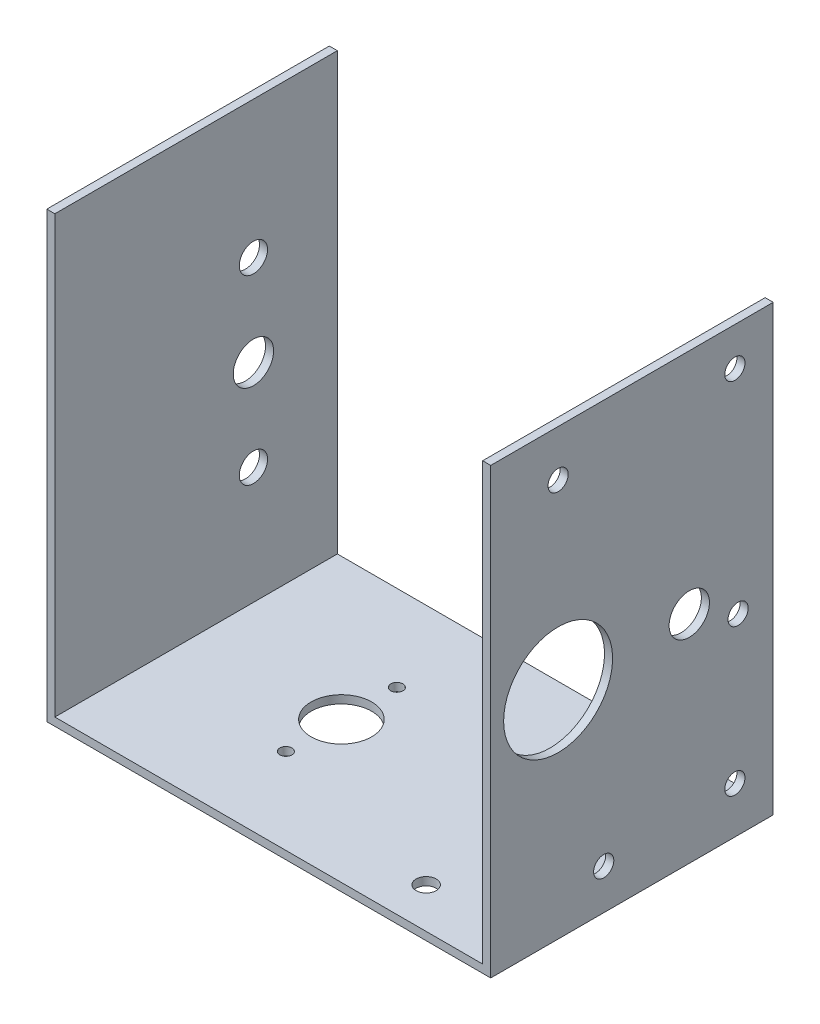
ISO-10303-21;
HEADER;
FILE_DESCRIPTION(('STEP AP214'),'2;1');
FILE_NAME('part.step','',(''),(''),'','','');
FILE_SCHEMA(('AUTOMOTIVE_DESIGN { 1 0 10303 214 1 1 1 1 }'));
ENDSEC;
DATA;
#1=APPLICATION_CONTEXT('core data for automotive mechanical design processes');
#2=APPLICATION_PROTOCOL_DEFINITION('international standard','automotive_design',2000,#1);
#3=PRODUCT_CONTEXT('',#1,'mechanical');
#4=PRODUCT('Part','Part','',(#3));
#5=PRODUCT_RELATED_PRODUCT_CATEGORY('part','',(#4));
#6=PRODUCT_DEFINITION_FORMATION('','',#4);
#7=PRODUCT_DEFINITION_CONTEXT('part definition',#1,'design');
#8=PRODUCT_DEFINITION('design','',#6,#7);
#9=PRODUCT_DEFINITION_SHAPE('','',#8);
#10=(LENGTH_UNIT() NAMED_UNIT(*) SI_UNIT(.MILLI.,.METRE.));
#11=(NAMED_UNIT(*) PLANE_ANGLE_UNIT() SI_UNIT($,.RADIAN.));
#12=(NAMED_UNIT(*) SI_UNIT($,.STERADIAN.) SOLID_ANGLE_UNIT());
#13=UNCERTAINTY_MEASURE_WITH_UNIT(LENGTH_MEASURE(1.E-05),#10,'distance_accuracy_value','');
#14=(GEOMETRIC_REPRESENTATION_CONTEXT(3) GLOBAL_UNCERTAINTY_ASSIGNED_CONTEXT((#13)) GLOBAL_UNIT_ASSIGNED_CONTEXT((#10,
#11,#12)) REPRESENTATION_CONTEXT('',''));
#15=CARTESIAN_POINT('',(0.,0.,0.));
#16=DIRECTION('',(0.,0.,1.));
#17=DIRECTION('',(1.,0.,0.));
#18=AXIS2_PLACEMENT_3D('',#15,#16,#17);
#19=CARTESIAN_POINT('',(0.,2.,0.));
#20=DIRECTION('',(0.,1.,0.));
#21=DIRECTION('',(0.,0.,1.));
#22=AXIS2_PLACEMENT_3D('',#19,#20,#21);
#23=PLANE('',#22);
#24=CARTESIAN_POINT('',(-17.,2.,-13.75));
#25=DIRECTION('',(0.,1.,0.));
#26=DIRECTION('',(0.,0.,1.));
#27=AXIS2_PLACEMENT_3D('',#24,#25,#26);
#28=CIRCLE('',#27,1.5);
#29=CARTESIAN_POINT('',(-17.,2.,-12.25));
#30=VERTEX_POINT('',#29);
#31=EDGE_CURVE('E223',#30,#30,#28,.T.);
#32=ORIENTED_EDGE('',*,*,#31,.F.);
#33=EDGE_LOOP('',(#32));
#34=FACE_BOUND('',#33,.T.);
#35=CARTESIAN_POINT('',(-17.,2.,13.75));
#36=DIRECTION('',(0.,1.,0.));
#37=DIRECTION('',(0.,0.,1.));
#38=AXIS2_PLACEMENT_3D('',#35,#36,#37);
#39=CIRCLE('',#38,1.5);
#40=CARTESIAN_POINT('',(-17.,2.,15.25));
#41=VERTEX_POINT('',#40);
#42=EDGE_CURVE('E231',#41,#41,#39,.T.);
#43=ORIENTED_EDGE('',*,*,#42,.F.);
#44=EDGE_LOOP('',(#43));
#45=FACE_BOUND('',#44,.T.);
#46=CARTESIAN_POINT('',(29.,2.,-25.));
#47=DIRECTION('',(0.,1.,0.));
#48=DIRECTION('',(0.,0.,1.));
#49=AXIS2_PLACEMENT_3D('',#46,#47,#48);
#50=CIRCLE('',#49,2.5);
#51=CARTESIAN_POINT('',(29.,2.,-22.5));
#52=VERTEX_POINT('',#51);
#53=EDGE_CURVE('E243',#52,#52,#50,.T.);
#54=ORIENTED_EDGE('',*,*,#53,.F.);
#55=EDGE_LOOP('',(#54));
#56=FACE_BOUND('',#55,.T.);
#57=CARTESIAN_POINT('',(29.,2.,25.));
#58=DIRECTION('',(0.,1.,0.));
#59=DIRECTION('',(0.,0.,1.));
#60=AXIS2_PLACEMENT_3D('',#57,#58,#59);
#61=CIRCLE('',#60,2.5);
#62=CARTESIAN_POINT('',(29.,2.,27.5));
#63=VERTEX_POINT('',#62);
#64=EDGE_CURVE('E248',#63,#63,#61,.T.);
#65=ORIENTED_EDGE('',*,*,#64,.F.);
#66=EDGE_LOOP('',(#65));
#67=FACE_BOUND('',#66,.T.);
#68=CARTESIAN_POINT('',(-17.,2.,0.));
#69=DIRECTION('',(0.,1.,0.));
#70=DIRECTION('',(0.,0.,1.));
#71=AXIS2_PLACEMENT_3D('',#68,#69,#70);
#72=CIRCLE('',#71,7.5);
#73=CARTESIAN_POINT('',(-17.,2.,7.50000000000001));
#74=VERTEX_POINT('',#73);
#75=EDGE_CURVE('E200',#74,#74,#72,.T.);
#76=ORIENTED_EDGE('',*,*,#75,.F.);
#77=EDGE_LOOP('',(#76));
#78=FACE_BOUND('',#77,.T.);
#79=DIRECTION('',(1.,0.,0.));
#80=VECTOR('',#79,1.);
#81=CARTESIAN_POINT('',(55.,2.,35.));
#82=LINE('',#81,#80);
#83=CARTESIAN_POINT('',(-53.,2.,35.));
#84=VERTEX_POINT('',#83);
#85=CARTESIAN_POINT('',(53.,2.,35.));
#86=VERTEX_POINT('',#85);
#87=EDGE_CURVE('E62',#84,#86,#82,.T.);
#88=ORIENTED_EDGE('',*,*,#87,.T.);
#89=DIRECTION('',(0.,0.,-1.));
#90=VECTOR('',#89,1.);
#91=CARTESIAN_POINT('',(53.,2.,0.));
#92=LINE('',#91,#90);
#93=CARTESIAN_POINT('',(53.,2.,-35.));
#94=VERTEX_POINT('',#93);
#95=EDGE_CURVE('E57',#86,#94,#92,.T.);
#96=ORIENTED_EDGE('',*,*,#95,.T.);
#97=DIRECTION('',(-1.,0.,0.));
#98=VECTOR('',#97,1.);
#99=CARTESIAN_POINT('',(55.,2.,-35.));
#100=LINE('',#99,#98);
#101=CARTESIAN_POINT('',(-53.,2.,-35.));
#102=VERTEX_POINT('',#101);
#103=EDGE_CURVE('E112',#94,#102,#100,.T.);
#104=ORIENTED_EDGE('',*,*,#103,.T.);
#105=DIRECTION('',(0.,0.,-1.));
#106=VECTOR('',#105,1.);
#107=CARTESIAN_POINT('',(-53.,2.,0.));
#108=LINE('',#107,#106);
#109=EDGE_CURVE('E163',#84,#102,#108,.T.);
#110=ORIENTED_EDGE('',*,*,#109,.F.);
#111=EDGE_LOOP('',(#88,#96,#104,#110));
#112=FACE_BOUND('',#111,.T.);
#113=ADVANCED_FACE('F39',(#34,#45,#56,#67,#78,#112),#23,.T.);
#114=CARTESIAN_POINT('',(-55.,2.,35.));
#115=DIRECTION('',(1.,0.,0.));
#116=DIRECTION('',(0.,0.,-1.));
#117=AXIS2_PLACEMENT_3D('',#114,#115,#116);
#118=PLANE('',#117);
#119=CARTESIAN_POINT('',(-55.,31.0000000000016,-14.1999999999985));
#120=DIRECTION('',(-1.,0.,0.));
#121=DIRECTION('',(0.,0.,1.));
#122=AXIS2_PLACEMENT_3D('',#119,#120,#121);
#123=CIRCLE('',#122,3.5);
#124=CARTESIAN_POINT('',(-55.,31.0000000000016,-10.6999999999985));
#125=VERTEX_POINT('',#124);
#126=EDGE_CURVE('E237',#125,#125,#123,.T.);
#127=ORIENTED_EDGE('',*,*,#126,.F.);
#128=EDGE_LOOP('',(#127));
#129=FACE_BOUND('',#128,.T.);
#130=CARTESIAN_POINT('',(-55.,76.0000000000016,-14.1999999999985));
#131=DIRECTION('',(-1.,0.,0.));
#132=DIRECTION('',(0.,0.,1.));
#133=AXIS2_PLACEMENT_3D('',#130,#131,#132);
#134=CIRCLE('',#133,3.5);
#135=CARTESIAN_POINT('',(-55.,76.0000000000016,-10.6999999999986));
#136=VERTEX_POINT('',#135);
#137=EDGE_CURVE('E240',#136,#136,#134,.T.);
#138=ORIENTED_EDGE('',*,*,#137,.F.);
#139=EDGE_LOOP('',(#138));
#140=FACE_BOUND('',#139,.T.);
#141=CARTESIAN_POINT('',(-55.,53.5000000000014,-14.1999999999985));
#142=DIRECTION('',(1.,0.,0.));
#143=DIRECTION('',(0.,0.,-1.));
#144=AXIS2_PLACEMENT_3D('',#141,#142,#143);
#145=CIRCLE('',#144,5.);
#146=CARTESIAN_POINT('',(-55.,53.5000000000014,-19.1999999999985));
#147=VERTEX_POINT('',#146);
#148=EDGE_CURVE('E219',#147,#147,#145,.T.);
#149=ORIENTED_EDGE('',*,*,#148,.T.);
#150=EDGE_LOOP('',(#149));
#151=FACE_BOUND('',#150,.T.);
#152=DIRECTION('',(0.,0.,1.));
#153=VECTOR('',#152,1.);
#154=CARTESIAN_POINT('',(-55.,0.,35.));
#155=LINE('',#154,#153);
#156=CARTESIAN_POINT('',(-55.,0.,-35.));
#157=VERTEX_POINT('',#156);
#158=CARTESIAN_POINT('',(-55.,0.,35.));
#159=VERTEX_POINT('',#158);
#160=EDGE_CURVE('E170',#157,#159,#155,.T.);
#161=ORIENTED_EDGE('',*,*,#160,.T.);
#162=DIRECTION('',(0.,-1.,0.));
#163=VECTOR('',#162,1.);
#164=CARTESIAN_POINT('',(-55.,2.,35.));
#165=LINE('',#164,#163);
#166=CARTESIAN_POINT('',(-55.,110.,35.));
#167=VERTEX_POINT('',#166);
#168=EDGE_CURVE('E11',#167,#159,#165,.T.);
#169=ORIENTED_EDGE('',*,*,#168,.F.);
#170=DIRECTION('',(0.,0.,-1.));
#171=VECTOR('',#170,1.);
#172=CARTESIAN_POINT('',(-55.,110.,-35.));
#173=LINE('',#172,#171);
#174=CARTESIAN_POINT('',(-55.,110.,-35.));
#175=VERTEX_POINT('',#174);
#176=EDGE_CURVE('E144',#167,#175,#173,.T.);
#177=ORIENTED_EDGE('',*,*,#176,.T.);
#178=DIRECTION('',(0.,-1.,0.));
#179=VECTOR('',#178,1.);
#180=CARTESIAN_POINT('',(-55.,2.,-35.));
#181=LINE('',#180,#179);
#182=EDGE_CURVE('E176',#175,#157,#181,.T.);
#183=ORIENTED_EDGE('',*,*,#182,.T.);
#184=EDGE_LOOP('',(#161,#169,#177,#183));
#185=FACE_BOUND('',#184,.T.);
#186=ADVANCED_FACE('F41',(#129,#140,#151,#185),#118,.F.);
#187=CARTESIAN_POINT('',(55.,2.,35.));
#188=DIRECTION('',(0.,0.,-1.));
#189=DIRECTION('',(-1.,0.,0.));
#190=AXIS2_PLACEMENT_3D('',#187,#188,#189);
#191=PLANE('',#190);
#192=DIRECTION('',(0.,-1.,0.));
#193=VECTOR('',#192,1.);
#194=CARTESIAN_POINT('',(55.,2.,35.));
#195=LINE('',#194,#193);
#196=CARTESIAN_POINT('',(55.,110.,35.));
#197=VERTEX_POINT('',#196);
#198=CARTESIAN_POINT('',(55.,0.,35.));
#199=VERTEX_POINT('',#198);
#200=EDGE_CURVE('E49',#197,#199,#195,.T.);
#201=ORIENTED_EDGE('',*,*,#200,.F.);
#202=DIRECTION('',(1.,0.,0.));
#203=VECTOR('',#202,1.);
#204=CARTESIAN_POINT('',(53.,110.,35.));
#205=LINE('',#204,#203);
#206=CARTESIAN_POINT('',(53.,110.,35.));
#207=VERTEX_POINT('',#206);
#208=EDGE_CURVE('E125',#207,#197,#205,.T.);
#209=ORIENTED_EDGE('',*,*,#208,.F.);
#210=DIRECTION('',(0.,-1.,0.));
#211=VECTOR('',#210,1.);
#212=CARTESIAN_POINT('',(53.,110.,35.));
#213=LINE('',#212,#211);
#214=EDGE_CURVE('E126',#207,#86,#213,.T.);
#215=ORIENTED_EDGE('',*,*,#214,.T.);
#216=ORIENTED_EDGE('',*,*,#87,.F.);
#217=DIRECTION('',(0.,1.,0.));
#218=VECTOR('',#217,1.);
#219=CARTESIAN_POINT('',(-53.,0.,35.));
#220=LINE('',#219,#218);
#221=CARTESIAN_POINT('',(-53.,110.,35.));
#222=VERTEX_POINT('',#221);
#223=EDGE_CURVE('E148',#84,#222,#220,.T.);
#224=ORIENTED_EDGE('',*,*,#223,.T.);
#225=DIRECTION('',(-1.,0.,0.));
#226=VECTOR('',#225,1.);
#227=CARTESIAN_POINT('',(-53.,110.,35.));
#228=LINE('',#227,#226);
#229=EDGE_CURVE('E155',#222,#167,#228,.T.);
#230=ORIENTED_EDGE('',*,*,#229,.T.);
#231=ORIENTED_EDGE('',*,*,#168,.T.);
#232=DIRECTION('',(1.,0.,0.));
#233=VECTOR('',#232,1.);
#234=CARTESIAN_POINT('',(55.,0.,35.));
#235=LINE('',#234,#233);
#236=EDGE_CURVE('E180',#159,#199,#235,.T.);
#237=ORIENTED_EDGE('',*,*,#236,.T.);
#238=EDGE_LOOP('',(#201,#209,#215,#216,#224,#230,#231,#237));
#239=FACE_BOUND('',#238,.T.);
#240=ADVANCED_FACE('F314',(#239),#191,.F.);
#241=CARTESIAN_POINT('',(55.,2.,35.));
#242=DIRECTION('',(-1.,0.,0.));
#243=DIRECTION('',(0.,0.,1.));
#244=AXIS2_PLACEMENT_3D('',#241,#242,#243);
#245=PLANE('',#244);
#246=CARTESIAN_POINT('',(55.,11.5,-25.5));
#247=DIRECTION('',(1.,0.,0.));
#248=DIRECTION('',(0.,0.,-1.));
#249=AXIS2_PLACEMENT_3D('',#246,#247,#248);
#250=CIRCLE('',#249,2.5);
#251=CARTESIAN_POINT('',(55.,11.5,-28.));
#252=VERTEX_POINT('',#251);
#253=EDGE_CURVE('E264',#252,#252,#250,.T.);
#254=ORIENTED_EDGE('',*,*,#253,.F.);
#255=EDGE_LOOP('',(#254));
#256=FACE_BOUND('',#255,.T.);
#257=CARTESIAN_POINT('',(55.,100.5,-25.5));
#258=DIRECTION('',(1.,0.,0.));
#259=DIRECTION('',(0.,0.,-1.));
#260=AXIS2_PLACEMENT_3D('',#257,#258,#259);
#261=CIRCLE('',#260,2.5);
#262=CARTESIAN_POINT('',(55.,100.5,-28.));
#263=VERTEX_POINT('',#262);
#264=EDGE_CURVE('E252',#263,#263,#261,.T.);
#265=ORIENTED_EDGE('',*,*,#264,.F.);
#266=EDGE_LOOP('',(#265));
#267=FACE_BOUND('',#266,.T.);
#268=CARTESIAN_POINT('',(55.,53.5000000000014,-14.1999999999985));
#269=DIRECTION('',(1.,0.,0.));
#270=DIRECTION('',(0.,0.,-1.));
#271=AXIS2_PLACEMENT_3D('',#268,#269,#270);
#272=CIRCLE('',#271,5.);
#273=CARTESIAN_POINT('',(55.,53.5000000000014,-19.1999999999985));
#274=VERTEX_POINT('',#273);
#275=EDGE_CURVE('E263',#274,#274,#272,.T.);
#276=ORIENTED_EDGE('',*,*,#275,.F.);
#277=EDGE_LOOP('',(#276));
#278=FACE_BOUND('',#277,.T.);
#279=CARTESIAN_POINT('',(55.,53.5000000000014,18.3000000000015));
#280=DIRECTION('',(-1.,0.,0.));
#281=DIRECTION('',(0.,0.,1.));
#282=AXIS2_PLACEMENT_3D('',#279,#280,#281);
#283=CIRCLE('',#282,13.5);
#284=CARTESIAN_POINT('',(55.,53.5000000000014,31.8000000000015));
#285=VERTEX_POINT('',#284);
#286=EDGE_CURVE('E288',#285,#285,#283,.T.);
#287=ORIENTED_EDGE('',*,*,#286,.T.);
#288=EDGE_LOOP('',(#287));
#289=FACE_BOUND('',#288,.T.);
#290=CARTESIAN_POINT('',(55.,98.5000000000014,18.3000000000015));
#291=DIRECTION('',(1.,0.,0.));
#292=DIRECTION('',(0.,0.,-1.));
#293=AXIS2_PLACEMENT_3D('',#290,#291,#292);
#294=CIRCLE('',#293,2.50000000000106);
#295=CARTESIAN_POINT('',(55.,98.5000000000014,15.8000000000004));
#296=VERTEX_POINT('',#295);
#297=EDGE_CURVE('E211',#296,#296,#294,.T.);
#298=ORIENTED_EDGE('',*,*,#297,.F.);
#299=EDGE_LOOP('',(#298));
#300=FACE_BOUND('',#299,.T.);
#301=CARTESIAN_POINT('',(55.,47.5000000000014,-26.2999999999985));
#302=DIRECTION('',(1.,0.,0.));
#303=DIRECTION('',(0.,0.,-1.));
#304=AXIS2_PLACEMENT_3D('',#301,#302,#303);
#305=CIRCLE('',#304,2.50000000000106);
#306=CARTESIAN_POINT('',(55.,47.5000000000014,-28.7999999999996));
#307=VERTEX_POINT('',#306);
#308=EDGE_CURVE('E292',#307,#307,#305,.T.);
#309=ORIENTED_EDGE('',*,*,#308,.F.);
#310=EDGE_LOOP('',(#309));
#311=FACE_BOUND('',#310,.T.);
#312=CARTESIAN_POINT('',(55.,9.99999999999999,7.));
#313=DIRECTION('',(1.,0.,0.));
#314=DIRECTION('',(0.,0.,-1.));
#315=AXIS2_PLACEMENT_3D('',#312,#313,#314);
#316=CIRCLE('',#315,2.5);
#317=CARTESIAN_POINT('',(55.,9.99999999999999,4.5));
#318=VERTEX_POINT('',#317);
#319=EDGE_CURVE('E205',#318,#318,#316,.T.);
#320=ORIENTED_EDGE('',*,*,#319,.F.);
#321=EDGE_LOOP('',(#320));
#322=FACE_BOUND('',#321,.T.);
#323=DIRECTION('',(0.,0.,-1.));
#324=VECTOR('',#323,1.);
#325=CARTESIAN_POINT('',(55.,0.,35.));
#326=LINE('',#325,#324);
#327=CARTESIAN_POINT('',(55.,0.,-35.));
#328=VERTEX_POINT('',#327);
#329=EDGE_CURVE('E183',#199,#328,#326,.T.);
#330=ORIENTED_EDGE('',*,*,#329,.T.);
#331=DIRECTION('',(0.,-1.,0.));
#332=VECTOR('',#331,1.);
#333=CARTESIAN_POINT('',(55.,2.,-35.));
#334=LINE('',#333,#332);
#335=CARTESIAN_POINT('',(55.,110.,-35.));
#336=VERTEX_POINT('',#335);
#337=EDGE_CURVE('E191',#336,#328,#334,.T.);
#338=ORIENTED_EDGE('',*,*,#337,.F.);
#339=DIRECTION('',(0.,0.,1.));
#340=VECTOR('',#339,1.);
#341=CARTESIAN_POINT('',(55.,110.,-35.));
#342=LINE('',#341,#340);
#343=EDGE_CURVE('E117',#336,#197,#342,.T.);
#344=ORIENTED_EDGE('',*,*,#343,.T.);
#345=ORIENTED_EDGE('',*,*,#200,.T.);
#346=EDGE_LOOP('',(#330,#338,#344,#345));
#347=FACE_BOUND('',#346,.T.);
#348=ADVANCED_FACE('F327',(#256,#267,#278,#289,#300,#311,#322,#347),#245,.F.);
#349=CARTESIAN_POINT('',(55.,2.,-35.));
#350=DIRECTION('',(0.,0.,1.));
#351=DIRECTION('',(1.,0.,0.));
#352=AXIS2_PLACEMENT_3D('',#349,#350,#351);
#353=PLANE('',#352);
#354=DIRECTION('',(-1.,0.,0.));
#355=VECTOR('',#354,1.);
#356=CARTESIAN_POINT('',(55.,0.,-35.));
#357=LINE('',#356,#355);
#358=EDGE_CURVE('E173',#328,#157,#357,.T.);
#359=ORIENTED_EDGE('',*,*,#358,.T.);
#360=ORIENTED_EDGE('',*,*,#182,.F.);
#361=DIRECTION('',(-1.,0.,0.));
#362=VECTOR('',#361,1.);
#363=CARTESIAN_POINT('',(-53.,110.,-35.));
#364=LINE('',#363,#362);
#365=CARTESIAN_POINT('',(-53.,110.,-35.));
#366=VERTEX_POINT('',#365);
#367=EDGE_CURVE('E159',#366,#175,#364,.T.);
#368=ORIENTED_EDGE('',*,*,#367,.F.);
#369=DIRECTION('',(0.,-1.,0.));
#370=VECTOR('',#369,1.);
#371=CARTESIAN_POINT('',(-53.,0.,-35.));
#372=LINE('',#371,#370);
#373=EDGE_CURVE('E145',#366,#102,#372,.T.);
#374=ORIENTED_EDGE('',*,*,#373,.T.);
#375=ORIENTED_EDGE('',*,*,#103,.F.);
#376=DIRECTION('',(0.,1.,0.));
#377=VECTOR('',#376,1.);
#378=CARTESIAN_POINT('',(53.,0.,-35.));
#379=LINE('',#378,#377);
#380=CARTESIAN_POINT('',(53.,110.,-35.));
#381=VERTEX_POINT('',#380);
#382=EDGE_CURVE('E105',#94,#381,#379,.T.);
#383=ORIENTED_EDGE('',*,*,#382,.T.);
#384=DIRECTION('',(1.,0.,0.));
#385=VECTOR('',#384,1.);
#386=CARTESIAN_POINT('',(53.,110.,-35.));
#387=LINE('',#386,#385);
#388=EDGE_CURVE('E109',#381,#336,#387,.T.);
#389=ORIENTED_EDGE('',*,*,#388,.T.);
#390=ORIENTED_EDGE('',*,*,#337,.T.);
#391=EDGE_LOOP('',(#359,#360,#368,#374,#375,#383,#389,#390));
#392=FACE_BOUND('',#391,.T.);
#393=ADVANCED_FACE('F107',(#392),#353,.F.);
#394=CARTESIAN_POINT('',(0.,0.,0.));
#395=DIRECTION('',(0.,1.,0.));
#396=DIRECTION('',(0.,0.,1.));
#397=AXIS2_PLACEMENT_3D('',#394,#395,#396);
#398=PLANE('',#397);
#399=CARTESIAN_POINT('',(-17.,0.,-13.75));
#400=DIRECTION('',(0.,1.,0.));
#401=DIRECTION('',(0.,0.,1.));
#402=AXIS2_PLACEMENT_3D('',#399,#400,#401);
#403=CIRCLE('',#402,1.5);
#404=CARTESIAN_POINT('',(-17.,0.,-12.25));
#405=VERTEX_POINT('',#404);
#406=EDGE_CURVE('E43',#405,#405,#403,.T.);
#407=ORIENTED_EDGE('',*,*,#406,.T.);
#408=EDGE_LOOP('',(#407));
#409=FACE_BOUND('',#408,.T.);
#410=CARTESIAN_POINT('',(-17.,0.,13.75));
#411=DIRECTION('',(0.,1.,0.));
#412=DIRECTION('',(0.,0.,1.));
#413=AXIS2_PLACEMENT_3D('',#410,#411,#412);
#414=CIRCLE('',#413,1.5);
#415=CARTESIAN_POINT('',(-17.,0.,15.25));
#416=VERTEX_POINT('',#415);
#417=EDGE_CURVE('E220',#416,#416,#414,.T.);
#418=ORIENTED_EDGE('',*,*,#417,.T.);
#419=EDGE_LOOP('',(#418));
#420=FACE_BOUND('',#419,.T.);
#421=CARTESIAN_POINT('',(29.,0.,-25.));
#422=DIRECTION('',(0.,1.,0.));
#423=DIRECTION('',(0.,0.,1.));
#424=AXIS2_PLACEMENT_3D('',#421,#422,#423);
#425=CIRCLE('',#424,2.5);
#426=CARTESIAN_POINT('',(29.,0.,-22.5));
#427=VERTEX_POINT('',#426);
#428=EDGE_CURVE('E247',#427,#427,#425,.F.);
#429=ORIENTED_EDGE('',*,*,#428,.F.);
#430=EDGE_LOOP('',(#429));
#431=FACE_BOUND('',#430,.T.);
#432=CARTESIAN_POINT('',(29.,0.,25.));
#433=DIRECTION('',(0.,1.,0.));
#434=DIRECTION('',(0.,0.,1.));
#435=AXIS2_PLACEMENT_3D('',#432,#433,#434);
#436=CIRCLE('',#435,2.5);
#437=CARTESIAN_POINT('',(29.,0.,27.5));
#438=VERTEX_POINT('',#437);
#439=EDGE_CURVE('E229',#438,#438,#436,.F.);
#440=ORIENTED_EDGE('',*,*,#439,.F.);
#441=EDGE_LOOP('',(#440));
#442=FACE_BOUND('',#441,.T.);
#443=CARTESIAN_POINT('',(-17.,0.,0.));
#444=DIRECTION('',(0.,1.,0.));
#445=DIRECTION('',(0.,0.,1.));
#446=AXIS2_PLACEMENT_3D('',#443,#444,#445);
#447=CIRCLE('',#446,7.5);
#448=CARTESIAN_POINT('',(-17.,0.,7.50000000000001));
#449=VERTEX_POINT('',#448);
#450=EDGE_CURVE('E139',#449,#449,#447,.T.);
#451=ORIENTED_EDGE('',*,*,#450,.T.);
#452=EDGE_LOOP('',(#451));
#453=FACE_BOUND('',#452,.T.);
#454=ORIENTED_EDGE('',*,*,#329,.F.);
#455=ORIENTED_EDGE('',*,*,#236,.F.);
#456=ORIENTED_EDGE('',*,*,#160,.F.);
#457=ORIENTED_EDGE('',*,*,#358,.F.);
#458=EDGE_LOOP('',(#454,#455,#456,#457));
#459=FACE_BOUND('',#458,.T.);
#460=ADVANCED_FACE('F321',(#409,#420,#431,#442,#453,#459),#398,.F.);
#461=CARTESIAN_POINT('',(-53.,110.,-35.));
#462=DIRECTION('',(0.,1.,0.));
#463=DIRECTION('',(0.,0.,1.));
#464=AXIS2_PLACEMENT_3D('',#461,#462,#463);
#465=PLANE('',#464);
#466=ORIENTED_EDGE('',*,*,#176,.F.);
#467=ORIENTED_EDGE('',*,*,#229,.F.);
#468=DIRECTION('',(0.,0.,-1.));
#469=VECTOR('',#468,1.);
#470=CARTESIAN_POINT('',(-53.,110.,-35.));
#471=LINE('',#470,#469);
#472=EDGE_CURVE('E151',#222,#366,#471,.T.);
#473=ORIENTED_EDGE('',*,*,#472,.T.);
#474=ORIENTED_EDGE('',*,*,#367,.T.);
#475=EDGE_LOOP('',(#466,#467,#473,#474));
#476=FACE_BOUND('',#475,.T.);
#477=ADVANCED_FACE('F319',(#476),#465,.T.);
#478=CARTESIAN_POINT('',(-53.,0.,0.));
#479=DIRECTION('',(1.,0.,0.));
#480=DIRECTION('',(0.,0.,-1.));
#481=AXIS2_PLACEMENT_3D('',#478,#479,#480);
#482=PLANE('',#481);
#483=CARTESIAN_POINT('',(-53.,31.0000000000016,-14.1999999999985));
#484=DIRECTION('',(1.,0.,0.));
#485=DIRECTION('',(0.,0.,-1.));
#486=AXIS2_PLACEMENT_3D('',#483,#484,#485);
#487=CIRCLE('',#486,3.5);
#488=CARTESIAN_POINT('',(-53.,31.0000000000016,-10.6999999999985));
#489=VERTEX_POINT('',#488);
#490=EDGE_CURVE('E418',#489,#489,#487,.F.);
#491=ORIENTED_EDGE('',*,*,#490,.T.);
#492=EDGE_LOOP('',(#491));
#493=FACE_BOUND('',#492,.T.);
#494=CARTESIAN_POINT('',(-53.,76.0000000000016,-14.1999999999985));
#495=DIRECTION('',(1.,0.,0.));
#496=DIRECTION('',(0.,0.,-1.));
#497=AXIS2_PLACEMENT_3D('',#494,#495,#496);
#498=CIRCLE('',#497,3.5);
#499=CARTESIAN_POINT('',(-53.,76.0000000000016,-10.6999999999986));
#500=VERTEX_POINT('',#499);
#501=EDGE_CURVE('E425',#500,#500,#498,.F.);
#502=ORIENTED_EDGE('',*,*,#501,.T.);
#503=EDGE_LOOP('',(#502));
#504=FACE_BOUND('',#503,.T.);
#505=CARTESIAN_POINT('',(-53.,53.5000000000014,-14.1999999999985));
#506=DIRECTION('',(1.,0.,0.));
#507=DIRECTION('',(0.,0.,-1.));
#508=AXIS2_PLACEMENT_3D('',#505,#506,#507);
#509=CIRCLE('',#508,5.);
#510=CARTESIAN_POINT('',(-53.,53.5000000000014,-19.1999999999985));
#511=VERTEX_POINT('',#510);
#512=EDGE_CURVE('E218',#511,#511,#509,.T.);
#513=ORIENTED_EDGE('',*,*,#512,.F.);
#514=EDGE_LOOP('',(#513));
#515=FACE_BOUND('',#514,.T.);
#516=ORIENTED_EDGE('',*,*,#223,.F.);
#517=ORIENTED_EDGE('',*,*,#109,.T.);
#518=ORIENTED_EDGE('',*,*,#373,.F.);
#519=ORIENTED_EDGE('',*,*,#472,.F.);
#520=EDGE_LOOP('',(#516,#517,#518,#519));
#521=FACE_BOUND('',#520,.T.);
#522=ADVANCED_FACE('F347',(#493,#504,#515,#521),#482,.T.);
#523=CARTESIAN_POINT('',(53.,110.,-35.));
#524=DIRECTION('',(0.,1.,0.));
#525=DIRECTION('',(0.,0.,1.));
#526=AXIS2_PLACEMENT_3D('',#523,#524,#525);
#527=PLANE('',#526);
#528=ORIENTED_EDGE('',*,*,#343,.F.);
#529=ORIENTED_EDGE('',*,*,#388,.F.);
#530=DIRECTION('',(0.,0.,1.));
#531=VECTOR('',#530,1.);
#532=CARTESIAN_POINT('',(53.,110.,-35.));
#533=LINE('',#532,#531);
#534=EDGE_CURVE('E116',#381,#207,#533,.T.);
#535=ORIENTED_EDGE('',*,*,#534,.T.);
#536=ORIENTED_EDGE('',*,*,#208,.T.);
#537=EDGE_LOOP('',(#528,#529,#535,#536));
#538=FACE_BOUND('',#537,.T.);
#539=ADVANCED_FACE('F121',(#538),#527,.T.);
#540=CARTESIAN_POINT('',(53.,0.,0.));
#541=DIRECTION('',(1.,0.,0.));
#542=DIRECTION('',(0.,0.,-1.));
#543=AXIS2_PLACEMENT_3D('',#540,#541,#542);
#544=PLANE('',#543);
#545=CARTESIAN_POINT('',(53.,11.5,-25.5));
#546=DIRECTION('',(1.,0.,0.));
#547=DIRECTION('',(0.,0.,-1.));
#548=AXIS2_PLACEMENT_3D('',#545,#546,#547);
#549=CIRCLE('',#548,2.5);
#550=CARTESIAN_POINT('',(53.,11.5,-28.));
#551=VERTEX_POINT('',#550);
#552=EDGE_CURVE('E259',#551,#551,#549,.T.);
#553=ORIENTED_EDGE('',*,*,#552,.T.);
#554=EDGE_LOOP('',(#553));
#555=FACE_BOUND('',#554,.T.);
#556=CARTESIAN_POINT('',(53.,100.5,-25.5));
#557=DIRECTION('',(1.,0.,0.));
#558=DIRECTION('',(0.,0.,-1.));
#559=AXIS2_PLACEMENT_3D('',#556,#557,#558);
#560=CIRCLE('',#559,2.5);
#561=CARTESIAN_POINT('',(53.,100.5,-28.));
#562=VERTEX_POINT('',#561);
#563=EDGE_CURVE('E268',#562,#562,#560,.T.);
#564=ORIENTED_EDGE('',*,*,#563,.T.);
#565=EDGE_LOOP('',(#564));
#566=FACE_BOUND('',#565,.T.);
#567=CARTESIAN_POINT('',(53.,53.5000000000014,-14.1999999999985));
#568=DIRECTION('',(1.,0.,0.));
#569=DIRECTION('',(0.,0.,-1.));
#570=AXIS2_PLACEMENT_3D('',#567,#568,#569);
#571=CIRCLE('',#570,5.);
#572=CARTESIAN_POINT('',(53.,53.5000000000014,-19.1999999999985));
#573=VERTEX_POINT('',#572);
#574=EDGE_CURVE('E215',#573,#573,#571,.T.);
#575=ORIENTED_EDGE('',*,*,#574,.T.);
#576=EDGE_LOOP('',(#575));
#577=FACE_BOUND('',#576,.T.);
#578=CARTESIAN_POINT('',(53.,53.5000000000014,18.3000000000015));
#579=DIRECTION('',(-1.,0.,0.));
#580=DIRECTION('',(0.,0.,1.));
#581=AXIS2_PLACEMENT_3D('',#578,#579,#580);
#582=CIRCLE('',#581,13.5);
#583=CARTESIAN_POINT('',(53.,53.5000000000014,31.8000000000015));
#584=VERTEX_POINT('',#583);
#585=EDGE_CURVE('E284',#584,#584,#582,.T.);
#586=ORIENTED_EDGE('',*,*,#585,.F.);
#587=EDGE_LOOP('',(#586));
#588=FACE_BOUND('',#587,.T.);
#589=CARTESIAN_POINT('',(53.,98.5000000000014,18.3000000000015));
#590=DIRECTION('',(1.,0.,0.));
#591=DIRECTION('',(0.,0.,-1.));
#592=AXIS2_PLACEMENT_3D('',#589,#590,#591);
#593=CIRCLE('',#592,2.50000000000106);
#594=CARTESIAN_POINT('',(53.,98.5000000000014,15.8000000000004));
#595=VERTEX_POINT('',#594);
#596=EDGE_CURVE('E210',#595,#595,#593,.T.);
#597=ORIENTED_EDGE('',*,*,#596,.T.);
#598=EDGE_LOOP('',(#597));
#599=FACE_BOUND('',#598,.T.);
#600=CARTESIAN_POINT('',(53.,47.5000000000014,-26.2999999999985));
#601=DIRECTION('',(1.,0.,0.));
#602=DIRECTION('',(0.,0.,-1.));
#603=AXIS2_PLACEMENT_3D('',#600,#601,#602);
#604=CIRCLE('',#603,2.50000000000106);
#605=CARTESIAN_POINT('',(53.,47.5000000000014,-28.7999999999996));
#606=VERTEX_POINT('',#605);
#607=EDGE_CURVE('E206',#606,#606,#604,.T.);
#608=ORIENTED_EDGE('',*,*,#607,.T.);
#609=EDGE_LOOP('',(#608));
#610=FACE_BOUND('',#609,.T.);
#611=CARTESIAN_POINT('',(53.,9.99999999999999,7.));
#612=DIRECTION('',(1.,0.,0.));
#613=DIRECTION('',(0.,0.,-1.));
#614=AXIS2_PLACEMENT_3D('',#611,#612,#613);
#615=CIRCLE('',#614,2.5);
#616=CARTESIAN_POINT('',(53.,9.99999999999999,4.5));
#617=VERTEX_POINT('',#616);
#618=EDGE_CURVE('E201',#617,#617,#615,.T.);
#619=ORIENTED_EDGE('',*,*,#618,.T.);
#620=EDGE_LOOP('',(#619));
#621=FACE_BOUND('',#620,.T.);
#622=ORIENTED_EDGE('',*,*,#95,.F.);
#623=ORIENTED_EDGE('',*,*,#214,.F.);
#624=ORIENTED_EDGE('',*,*,#534,.F.);
#625=ORIENTED_EDGE('',*,*,#382,.F.);
#626=EDGE_LOOP('',(#622,#623,#624,#625));
#627=FACE_BOUND('',#626,.T.);
#628=ADVANCED_FACE('F129',(#555,#566,#577,#588,#599,#610,#621,#627),#544,.F.);
#629=CARTESIAN_POINT('',(-17.,-4.35,0.));
#630=DIRECTION('',(0.,1.,0.));
#631=DIRECTION('',(0.,0.,1.));
#632=AXIS2_PLACEMENT_3D('',#629,#630,#631);
#633=CYLINDRICAL_SURFACE('',#632,7.5);
#634=ORIENTED_EDGE('',*,*,#75,.T.);
#635=EDGE_LOOP('',(#634));
#636=FACE_BOUND('',#635,.T.);
#637=ORIENTED_EDGE('',*,*,#450,.F.);
#638=EDGE_LOOP('',(#637));
#639=FACE_BOUND('',#638,.T.);
#640=ADVANCED_FACE('F305',(#636,#639),#633,.F.);
#641=CARTESIAN_POINT('',(45.,9.99999999999999,7.));
#642=DIRECTION('',(1.,0.,0.));
#643=DIRECTION('',(0.,0.,-1.));
#644=AXIS2_PLACEMENT_3D('',#641,#642,#643);
#645=CYLINDRICAL_SURFACE('',#644,2.5);
#646=ORIENTED_EDGE('',*,*,#319,.T.);
#647=EDGE_LOOP('',(#646));
#648=FACE_BOUND('',#647,.T.);
#649=ORIENTED_EDGE('',*,*,#618,.F.);
#650=EDGE_LOOP('',(#649));
#651=FACE_BOUND('',#650,.T.);
#652=ADVANCED_FACE('F363',(#648,#651),#645,.F.);
#653=CARTESIAN_POINT('',(45.,47.5000000000014,-26.2999999999985));
#654=DIRECTION('',(1.,0.,0.));
#655=DIRECTION('',(0.,0.,-1.));
#656=AXIS2_PLACEMENT_3D('',#653,#654,#655);
#657=CYLINDRICAL_SURFACE('',#656,2.50000000000106);
#658=ORIENTED_EDGE('',*,*,#308,.T.);
#659=EDGE_LOOP('',(#658));
#660=FACE_BOUND('',#659,.T.);
#661=ORIENTED_EDGE('',*,*,#607,.F.);
#662=EDGE_LOOP('',(#661));
#663=FACE_BOUND('',#662,.T.);
#664=ADVANCED_FACE('F366',(#660,#663),#657,.F.);
#665=CARTESIAN_POINT('',(45.,98.5000000000014,18.3000000000015));
#666=DIRECTION('',(1.,0.,0.));
#667=DIRECTION('',(0.,0.,-1.));
#668=AXIS2_PLACEMENT_3D('',#665,#666,#667);
#669=CYLINDRICAL_SURFACE('',#668,2.50000000000106);
#670=ORIENTED_EDGE('',*,*,#297,.T.);
#671=EDGE_LOOP('',(#670));
#672=FACE_BOUND('',#671,.T.);
#673=ORIENTED_EDGE('',*,*,#596,.F.);
#674=EDGE_LOOP('',(#673));
#675=FACE_BOUND('',#674,.T.);
#676=ADVANCED_FACE('F370',(#672,#675),#669,.F.);
#677=CARTESIAN_POINT('',(63.,53.5000000000014,18.3000000000015));
#678=DIRECTION('',(-1.,0.,0.));
#679=DIRECTION('',(0.,0.,1.));
#680=AXIS2_PLACEMENT_3D('',#677,#678,#679);
#681=CYLINDRICAL_SURFACE('',#680,13.5);
#682=ORIENTED_EDGE('',*,*,#585,.T.);
#683=EDGE_LOOP('',(#682));
#684=FACE_BOUND('',#683,.T.);
#685=ORIENTED_EDGE('',*,*,#286,.F.);
#686=EDGE_LOOP('',(#685));
#687=FACE_BOUND('',#686,.T.);
#688=ADVANCED_FACE('F374',(#684,#687),#681,.F.);
#689=CARTESIAN_POINT('',(-55.,53.5000000000014,-14.1999999999985));
#690=DIRECTION('',(1.,0.,0.));
#691=DIRECTION('',(0.,0.,-1.));
#692=AXIS2_PLACEMENT_3D('',#689,#690,#691);
#693=CYLINDRICAL_SURFACE('',#692,5.);
#694=ORIENTED_EDGE('',*,*,#275,.T.);
#695=EDGE_LOOP('',(#694));
#696=FACE_BOUND('',#695,.T.);
#697=ORIENTED_EDGE('',*,*,#574,.F.);
#698=EDGE_LOOP('',(#697));
#699=FACE_BOUND('',#698,.T.);
#700=ADVANCED_FACE('F378',(#696,#699),#693,.F.);
#701=ORIENTED_EDGE('',*,*,#512,.T.);
#702=EDGE_LOOP('',(#701));
#703=FACE_BOUND('',#702,.T.);
#704=ORIENTED_EDGE('',*,*,#148,.F.);
#705=EDGE_LOOP('',(#704));
#706=FACE_BOUND('',#705,.T.);
#707=ADVANCED_FACE('F380',(#703,#706),#693,.F.);
#708=CARTESIAN_POINT('',(53.,100.5,-25.5));
#709=DIRECTION('',(1.,0.,0.));
#710=DIRECTION('',(0.,0.,-1.));
#711=AXIS2_PLACEMENT_3D('',#708,#709,#710);
#712=CYLINDRICAL_SURFACE('',#711,2.5);
#713=ORIENTED_EDGE('',*,*,#563,.F.);
#714=EDGE_LOOP('',(#713));
#715=FACE_BOUND('',#714,.T.);
#716=ORIENTED_EDGE('',*,*,#264,.T.);
#717=EDGE_LOOP('',(#716));
#718=FACE_BOUND('',#717,.T.);
#719=ADVANCED_FACE('F383',(#715,#718),#712,.F.);
#720=CARTESIAN_POINT('',(53.,11.5,-25.5));
#721=DIRECTION('',(1.,0.,0.));
#722=DIRECTION('',(0.,0.,-1.));
#723=AXIS2_PLACEMENT_3D('',#720,#721,#722);
#724=CYLINDRICAL_SURFACE('',#723,2.5);
#725=ORIENTED_EDGE('',*,*,#552,.F.);
#726=EDGE_LOOP('',(#725));
#727=FACE_BOUND('',#726,.T.);
#728=ORIENTED_EDGE('',*,*,#253,.T.);
#729=EDGE_LOOP('',(#728));
#730=FACE_BOUND('',#729,.T.);
#731=ADVANCED_FACE('F387',(#727,#730),#724,.F.);
#732=CARTESIAN_POINT('',(29.,-0.00100000000000013,25.));
#733=DIRECTION('',(0.,1.,0.));
#734=DIRECTION('',(0.,0.,1.));
#735=AXIS2_PLACEMENT_3D('',#732,#733,#734);
#736=CYLINDRICAL_SURFACE('',#735,2.5);
#737=ORIENTED_EDGE('',*,*,#64,.T.);
#738=EDGE_LOOP('',(#737));
#739=FACE_BOUND('',#738,.T.);
#740=ORIENTED_EDGE('',*,*,#439,.T.);
#741=EDGE_LOOP('',(#740));
#742=FACE_BOUND('',#741,.T.);
#743=ADVANCED_FACE('F391',(#739,#742),#736,.F.);
#744=CARTESIAN_POINT('',(29.,-0.00100000000000013,-25.));
#745=DIRECTION('',(0.,1.,0.));
#746=DIRECTION('',(0.,0.,1.));
#747=AXIS2_PLACEMENT_3D('',#744,#745,#746);
#748=CYLINDRICAL_SURFACE('',#747,2.5);
#749=ORIENTED_EDGE('',*,*,#53,.T.);
#750=EDGE_LOOP('',(#749));
#751=FACE_BOUND('',#750,.T.);
#752=ORIENTED_EDGE('',*,*,#428,.T.);
#753=EDGE_LOOP('',(#752));
#754=FACE_BOUND('',#753,.T.);
#755=ADVANCED_FACE('F395',(#751,#754),#748,.F.);
#756=CARTESIAN_POINT('',(-17.,-8.,13.75));
#757=DIRECTION('',(0.,1.,0.));
#758=DIRECTION('',(0.,0.,1.));
#759=AXIS2_PLACEMENT_3D('',#756,#757,#758);
#760=CYLINDRICAL_SURFACE('',#759,1.5);
#761=ORIENTED_EDGE('',*,*,#42,.T.);
#762=EDGE_LOOP('',(#761));
#763=FACE_BOUND('',#762,.T.);
#764=ORIENTED_EDGE('',*,*,#417,.F.);
#765=EDGE_LOOP('',(#764));
#766=FACE_BOUND('',#765,.T.);
#767=ADVANCED_FACE('F399',(#763,#766),#760,.F.);
#768=CARTESIAN_POINT('',(-17.,-8.,-13.75));
#769=DIRECTION('',(0.,1.,0.));
#770=DIRECTION('',(0.,0.,1.));
#771=AXIS2_PLACEMENT_3D('',#768,#769,#770);
#772=CYLINDRICAL_SURFACE('',#771,1.5);
#773=ORIENTED_EDGE('',*,*,#31,.T.);
#774=EDGE_LOOP('',(#773));
#775=FACE_BOUND('',#774,.T.);
#776=ORIENTED_EDGE('',*,*,#406,.F.);
#777=EDGE_LOOP('',(#776));
#778=FACE_BOUND('',#777,.T.);
#779=ADVANCED_FACE('F403',(#775,#778),#772,.F.);
#780=CARTESIAN_POINT('',(55.001,76.0000000000016,-14.1999999999985));
#781=DIRECTION('',(-1.,0.,0.));
#782=DIRECTION('',(0.,0.,1.));
#783=AXIS2_PLACEMENT_3D('',#780,#781,#782);
#784=CYLINDRICAL_SURFACE('',#783,3.5);
#785=CARTESIAN_POINT('',(-53.,76.0000000000016,-10.6999999999986));
#786=CARTESIAN_POINT('',(-53.0208333333333,76.0000000000016,-10.6999999999986));
#787=CARTESIAN_POINT('',(-53.0416666666667,76.0000000000016,-10.6999999999986));
#788=CARTESIAN_POINT('',(-53.0833333333333,76.0000000000016,-10.6999999999986));
#789=CARTESIAN_POINT('',(-53.1041666666667,76.0000000000016,-10.6999999999986));
#790=CARTESIAN_POINT('',(-53.1458333333333,76.0000000000016,-10.6999999999986));
#791=CARTESIAN_POINT('',(-53.1666666666667,76.0000000000016,-10.6999999999986));
#792=CARTESIAN_POINT('',(-53.2083333333333,76.0000000000016,-10.6999999999986));
#793=CARTESIAN_POINT('',(-53.2291666666667,76.0000000000016,-10.6999999999986));
#794=CARTESIAN_POINT('',(-53.2708333333333,76.0000000000016,-10.6999999999986));
#795=CARTESIAN_POINT('',(-53.2916666666667,76.0000000000016,-10.6999999999986));
#796=CARTESIAN_POINT('',(-53.3333333333333,76.0000000000016,-10.6999999999986));
#797=CARTESIAN_POINT('',(-53.3541666666667,76.0000000000016,-10.6999999999986));
#798=CARTESIAN_POINT('',(-53.3958333333333,76.0000000000016,-10.6999999999986));
#799=CARTESIAN_POINT('',(-53.4166666666667,76.0000000000016,-10.6999999999986));
#800=CARTESIAN_POINT('',(-53.4583333333333,76.0000000000016,-10.6999999999986));
#801=CARTESIAN_POINT('',(-53.4791666666667,76.0000000000016,-10.6999999999986));
#802=CARTESIAN_POINT('',(-53.5208333333333,76.0000000000016,-10.6999999999986));
#803=CARTESIAN_POINT('',(-53.5416666666667,76.0000000000016,-10.6999999999986));
#804=CARTESIAN_POINT('',(-53.5833333333333,76.0000000000016,-10.6999999999986));
#805=CARTESIAN_POINT('',(-53.6041666666667,76.0000000000016,-10.6999999999986));
#806=CARTESIAN_POINT('',(-53.6458333333333,76.0000000000016,-10.6999999999986));
#807=CARTESIAN_POINT('',(-53.6666666666667,76.0000000000016,-10.6999999999986));
#808=CARTESIAN_POINT('',(-53.7083333333333,76.0000000000016,-10.6999999999986));
#809=CARTESIAN_POINT('',(-53.7291666666667,76.0000000000016,-10.6999999999986));
#810=CARTESIAN_POINT('',(-53.7708333333333,76.0000000000016,-10.6999999999986));
#811=CARTESIAN_POINT('',(-53.7916666666667,76.0000000000016,-10.6999999999986));
#812=CARTESIAN_POINT('',(-53.8333333333333,76.0000000000016,-10.6999999999986));
#813=CARTESIAN_POINT('',(-53.8541666666667,76.0000000000016,-10.6999999999986));
#814=CARTESIAN_POINT('',(-53.8958333333333,76.0000000000016,-10.6999999999986));
#815=CARTESIAN_POINT('',(-53.9166666666667,76.0000000000016,-10.6999999999986));
#816=CARTESIAN_POINT('',(-53.9583333333333,76.0000000000016,-10.6999999999986));
#817=CARTESIAN_POINT('',(-53.9791666666667,76.0000000000016,-10.6999999999986));
#818=CARTESIAN_POINT('',(-54.0208333333333,76.0000000000016,-10.6999999999986));
#819=CARTESIAN_POINT('',(-54.0416666666667,76.0000000000016,-10.6999999999986));
#820=CARTESIAN_POINT('',(-54.0833333333333,76.0000000000016,-10.6999999999986));
#821=CARTESIAN_POINT('',(-54.1041666666667,76.0000000000016,-10.6999999999986));
#822=CARTESIAN_POINT('',(-54.1458333333333,76.0000000000016,-10.6999999999986));
#823=CARTESIAN_POINT('',(-54.1666666666667,76.0000000000016,-10.6999999999986));
#824=CARTESIAN_POINT('',(-54.2083333333333,76.0000000000016,-10.6999999999986));
#825=CARTESIAN_POINT('',(-54.2291666666667,76.0000000000016,-10.6999999999986));
#826=CARTESIAN_POINT('',(-54.2708333333333,76.0000000000016,-10.6999999999986));
#827=CARTESIAN_POINT('',(-54.2916666666667,76.0000000000016,-10.6999999999986));
#828=CARTESIAN_POINT('',(-54.3333333333333,76.0000000000016,-10.6999999999986));
#829=CARTESIAN_POINT('',(-54.3541666666667,76.0000000000016,-10.6999999999986));
#830=CARTESIAN_POINT('',(-54.3958333333333,76.0000000000016,-10.6999999999986));
#831=CARTESIAN_POINT('',(-54.4166666666667,76.0000000000016,-10.6999999999986));
#832=CARTESIAN_POINT('',(-54.4583333333333,76.0000000000016,-10.6999999999986));
#833=CARTESIAN_POINT('',(-54.4791666666667,76.0000000000016,-10.6999999999986));
#834=CARTESIAN_POINT('',(-54.5208333333333,76.0000000000016,-10.6999999999986));
#835=CARTESIAN_POINT('',(-54.5416666666667,76.0000000000016,-10.6999999999986));
#836=CARTESIAN_POINT('',(-54.5833333333333,76.0000000000016,-10.6999999999986));
#837=CARTESIAN_POINT('',(-54.6041666666667,76.0000000000016,-10.6999999999986));
#838=CARTESIAN_POINT('',(-54.6458333333333,76.0000000000016,-10.6999999999986));
#839=CARTESIAN_POINT('',(-54.6666666666667,76.0000000000016,-10.6999999999986));
#840=CARTESIAN_POINT('',(-54.7083333333333,76.0000000000016,-10.6999999999986));
#841=CARTESIAN_POINT('',(-54.7291666666667,76.0000000000016,-10.6999999999986));
#842=CARTESIAN_POINT('',(-54.7708333333333,76.0000000000016,-10.6999999999986));
#843=CARTESIAN_POINT('',(-54.7916666666667,76.0000000000016,-10.6999999999986));
#844=CARTESIAN_POINT('',(-54.8333333333333,76.0000000000016,-10.6999999999986));
#845=CARTESIAN_POINT('',(-54.8541666666667,76.0000000000016,-10.6999999999986));
#846=CARTESIAN_POINT('',(-54.8958333333333,76.0000000000016,-10.6999999999986));
#847=CARTESIAN_POINT('',(-54.9166666666667,76.0000000000016,-10.6999999999986));
#848=CARTESIAN_POINT('',(-54.9583333333333,76.0000000000016,-10.6999999999986));
#849=CARTESIAN_POINT('',(-54.9791666666667,76.0000000000016,-10.6999999999986));
#850=CARTESIAN_POINT('',(-55.,76.0000000000016,-10.6999999999986));
#851=B_SPLINE_CURVE_WITH_KNOTS('',3,(#785,#786,#787,#788,#789,#790,#791,#792,#793,#794,#795,
#796,#797,#798,#799,#800,#801,#802,#803,#804,#805,#806,#807,#808,#809,#810,#811,#812,#813,#814,
#815,#816,#817,#818,#819,#820,#821,#822,#823,#824,#825,#826,#827,#828,#829,#830,#831,#832,#833,
#834,#835,#836,#837,#838,#839,#840,#841,#842,#843,#844,#845,#846,#847,#848,#849,#850),
.UNSPECIFIED.,.F.,.F.,(4,2,2,2,2,2,2,2,2,2,2,2,2,2,2,2,2,2,2,2,2,2,2,2,2,2,2,2,2,2,2,2,4),(0.,
0.0624999999999931,0.125,0.187500000000007,0.25,0.312499999999993,0.375,0.437500000000007,0.5,
0.562499999999994,0.625000000000001,0.687500000000008,0.750000000000001,0.812499999999994,
0.875000000000001,0.937500000000008,1.,1.06249999999999,1.125,1.18750000000001,1.25,
1.31249999999999,1.375,1.43750000000001,1.5,1.56249999999999,1.625,1.68750000000001,1.75,
1.81249999999999,1.875,1.93750000000001,2.),.UNSPECIFIED.);
#852=EDGE_CURVE('BSEAM407',#500,#136,#851,.T.);
#853=ORIENTED_EDGE('',*,*,#501,.F.);
#854=ORIENTED_EDGE('',*,*,#137,.T.);
#855=ORIENTED_EDGE('',*,*,#852,.T.);
#856=ORIENTED_EDGE('',*,*,#852,.F.);
#857=EDGE_LOOP('',(#853,#855,#854,#856));
#858=FACE_BOUND('',#857,.T.);
#859=ADVANCED_FACE('F407',(#858),#784,.F.);
#860=CARTESIAN_POINT('',(55.001,31.0000000000016,-14.1999999999985));
#861=DIRECTION('',(-1.,0.,0.));
#862=DIRECTION('',(0.,0.,1.));
#863=AXIS2_PLACEMENT_3D('',#860,#861,#862);
#864=CYLINDRICAL_SURFACE('',#863,3.5);
#865=CARTESIAN_POINT('',(-53.,31.0000000000016,-10.6999999999985));
#866=CARTESIAN_POINT('',(-53.0208333333333,31.0000000000016,-10.6999999999985));
#867=CARTESIAN_POINT('',(-53.0416666666667,31.0000000000016,-10.6999999999985));
#868=CARTESIAN_POINT('',(-53.0833333333333,31.0000000000016,-10.6999999999985));
#869=CARTESIAN_POINT('',(-53.1041666666667,31.0000000000016,-10.6999999999985));
#870=CARTESIAN_POINT('',(-53.1458333333333,31.0000000000016,-10.6999999999985));
#871=CARTESIAN_POINT('',(-53.1666666666667,31.0000000000016,-10.6999999999985));
#872=CARTESIAN_POINT('',(-53.2083333333333,31.0000000000016,-10.6999999999985));
#873=CARTESIAN_POINT('',(-53.2291666666667,31.0000000000016,-10.6999999999985));
#874=CARTESIAN_POINT('',(-53.2708333333333,31.0000000000016,-10.6999999999985));
#875=CARTESIAN_POINT('',(-53.2916666666667,31.0000000000016,-10.6999999999985));
#876=CARTESIAN_POINT('',(-53.3333333333333,31.0000000000016,-10.6999999999985));
#877=CARTESIAN_POINT('',(-53.3541666666667,31.0000000000016,-10.6999999999985));
#878=CARTESIAN_POINT('',(-53.3958333333333,31.0000000000016,-10.6999999999985));
#879=CARTESIAN_POINT('',(-53.4166666666667,31.0000000000016,-10.6999999999985));
#880=CARTESIAN_POINT('',(-53.4583333333333,31.0000000000016,-10.6999999999985));
#881=CARTESIAN_POINT('',(-53.4791666666667,31.0000000000016,-10.6999999999985));
#882=CARTESIAN_POINT('',(-53.5208333333333,31.0000000000016,-10.6999999999985));
#883=CARTESIAN_POINT('',(-53.5416666666667,31.0000000000016,-10.6999999999985));
#884=CARTESIAN_POINT('',(-53.5833333333333,31.0000000000016,-10.6999999999985));
#885=CARTESIAN_POINT('',(-53.6041666666667,31.0000000000016,-10.6999999999985));
#886=CARTESIAN_POINT('',(-53.6458333333333,31.0000000000016,-10.6999999999985));
#887=CARTESIAN_POINT('',(-53.6666666666667,31.0000000000016,-10.6999999999985));
#888=CARTESIAN_POINT('',(-53.7083333333333,31.0000000000016,-10.6999999999985));
#889=CARTESIAN_POINT('',(-53.7291666666667,31.0000000000016,-10.6999999999985));
#890=CARTESIAN_POINT('',(-53.7708333333333,31.0000000000016,-10.6999999999985));
#891=CARTESIAN_POINT('',(-53.7916666666667,31.0000000000016,-10.6999999999985));
#892=CARTESIAN_POINT('',(-53.8333333333333,31.0000000000016,-10.6999999999985));
#893=CARTESIAN_POINT('',(-53.8541666666667,31.0000000000016,-10.6999999999985));
#894=CARTESIAN_POINT('',(-53.8958333333333,31.0000000000016,-10.6999999999985));
#895=CARTESIAN_POINT('',(-53.9166666666667,31.0000000000016,-10.6999999999985));
#896=CARTESIAN_POINT('',(-53.9583333333333,31.0000000000016,-10.6999999999985));
#897=CARTESIAN_POINT('',(-53.9791666666667,31.0000000000016,-10.6999999999985));
#898=CARTESIAN_POINT('',(-54.0208333333333,31.0000000000016,-10.6999999999985));
#899=CARTESIAN_POINT('',(-54.0416666666667,31.0000000000016,-10.6999999999985));
#900=CARTESIAN_POINT('',(-54.0833333333333,31.0000000000016,-10.6999999999985));
#901=CARTESIAN_POINT('',(-54.1041666666667,31.0000000000016,-10.6999999999985));
#902=CARTESIAN_POINT('',(-54.1458333333333,31.0000000000016,-10.6999999999985));
#903=CARTESIAN_POINT('',(-54.1666666666667,31.0000000000016,-10.6999999999985));
#904=CARTESIAN_POINT('',(-54.2083333333333,31.0000000000016,-10.6999999999985));
#905=CARTESIAN_POINT('',(-54.2291666666667,31.0000000000016,-10.6999999999985));
#906=CARTESIAN_POINT('',(-54.2708333333333,31.0000000000016,-10.6999999999985));
#907=CARTESIAN_POINT('',(-54.2916666666667,31.0000000000016,-10.6999999999985));
#908=CARTESIAN_POINT('',(-54.3333333333333,31.0000000000016,-10.6999999999985));
#909=CARTESIAN_POINT('',(-54.3541666666667,31.0000000000016,-10.6999999999985));
#910=CARTESIAN_POINT('',(-54.3958333333333,31.0000000000016,-10.6999999999985));
#911=CARTESIAN_POINT('',(-54.4166666666667,31.0000000000016,-10.6999999999985));
#912=CARTESIAN_POINT('',(-54.4583333333333,31.0000000000016,-10.6999999999985));
#913=CARTESIAN_POINT('',(-54.4791666666667,31.0000000000016,-10.6999999999985));
#914=CARTESIAN_POINT('',(-54.5208333333333,31.0000000000016,-10.6999999999985));
#915=CARTESIAN_POINT('',(-54.5416666666667,31.0000000000016,-10.6999999999985));
#916=CARTESIAN_POINT('',(-54.5833333333333,31.0000000000016,-10.6999999999985));
#917=CARTESIAN_POINT('',(-54.6041666666667,31.0000000000016,-10.6999999999985));
#918=CARTESIAN_POINT('',(-54.6458333333333,31.0000000000016,-10.6999999999985));
#919=CARTESIAN_POINT('',(-54.6666666666667,31.0000000000016,-10.6999999999985));
#920=CARTESIAN_POINT('',(-54.7083333333333,31.0000000000016,-10.6999999999985));
#921=CARTESIAN_POINT('',(-54.7291666666667,31.0000000000016,-10.6999999999985));
#922=CARTESIAN_POINT('',(-54.7708333333333,31.0000000000016,-10.6999999999985));
#923=CARTESIAN_POINT('',(-54.7916666666667,31.0000000000016,-10.6999999999985));
#924=CARTESIAN_POINT('',(-54.8333333333333,31.0000000000016,-10.6999999999985));
#925=CARTESIAN_POINT('',(-54.8541666666667,31.0000000000016,-10.6999999999985));
#926=CARTESIAN_POINT('',(-54.8958333333333,31.0000000000016,-10.6999999999985));
#927=CARTESIAN_POINT('',(-54.9166666666667,31.0000000000016,-10.6999999999985));
#928=CARTESIAN_POINT('',(-54.9583333333333,31.0000000000016,-10.6999999999985));
#929=CARTESIAN_POINT('',(-54.9791666666667,31.0000000000016,-10.6999999999985));
#930=CARTESIAN_POINT('',(-55.,31.0000000000016,-10.6999999999985));
#931=B_SPLINE_CURVE_WITH_KNOTS('',3,(#865,#866,#867,#868,#869,#870,#871,#872,#873,#874,#875,
#876,#877,#878,#879,#880,#881,#882,#883,#884,#885,#886,#887,#888,#889,#890,#891,#892,#893,#894,
#895,#896,#897,#898,#899,#900,#901,#902,#903,#904,#905,#906,#907,#908,#909,#910,#911,#912,#913,
#914,#915,#916,#917,#918,#919,#920,#921,#922,#923,#924,#925,#926,#927,#928,#929,#930),
.UNSPECIFIED.,.F.,.F.,(4,2,2,2,2,2,2,2,2,2,2,2,2,2,2,2,2,2,2,2,2,2,2,2,2,2,2,2,2,2,2,2,4),(0.,
0.0624999999999931,0.125,0.187500000000007,0.25,0.312499999999993,0.375,0.437500000000007,0.5,
0.562499999999994,0.625000000000001,0.687500000000008,0.750000000000001,0.812499999999994,
0.875000000000001,0.937500000000008,1.,1.06249999999999,1.125,1.18750000000001,1.25,
1.31249999999999,1.375,1.43750000000001,1.5,1.56249999999999,1.625,1.68750000000001,1.75,
1.81249999999999,1.875,1.93750000000001,2.),.UNSPECIFIED.);
#932=EDGE_CURVE('BSEAM410',#489,#125,#931,.T.);
#933=ORIENTED_EDGE('',*,*,#490,.F.);
#934=ORIENTED_EDGE('',*,*,#126,.T.);
#935=ORIENTED_EDGE('',*,*,#932,.T.);
#936=ORIENTED_EDGE('',*,*,#932,.F.);
#937=EDGE_LOOP('',(#933,#935,#934,#936));
#938=FACE_BOUND('',#937,.T.);
#939=ADVANCED_FACE('F410',(#938),#864,.F.);
#940=CLOSED_SHELL('',(#113,#186,#240,#348,#393,#460,#477,#522,#539,#628,#640,#652,#664,#676,
#688,#700,#707,#719,#731,#743,#755,#767,#779,#859,#939));
#941=MANIFOLD_SOLID_BREP('B2',#940);
#942=ADVANCED_BREP_SHAPE_REPRESENTATION('',(#18,#941),#14);
#943=SHAPE_DEFINITION_REPRESENTATION(#9,#942);
ENDSEC;
END-ISO-10303-21;
